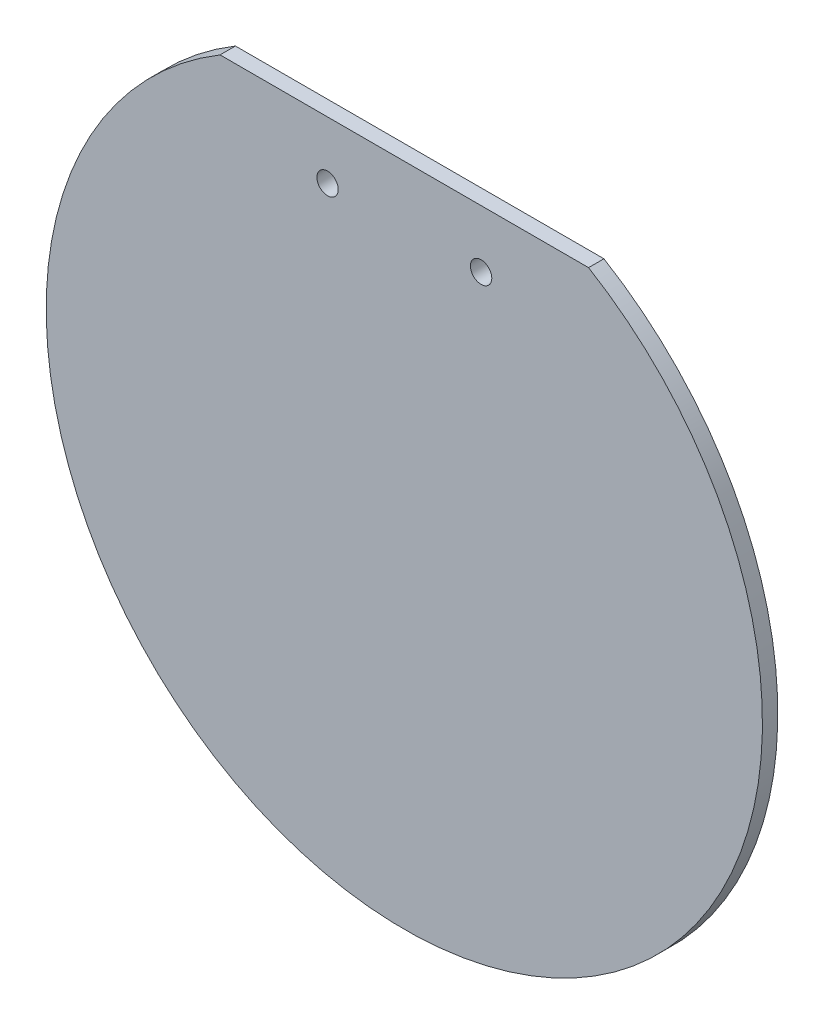
ISO-10303-21;
HEADER;
FILE_DESCRIPTION(('STEP AP214'),'2;1');
FILE_NAME('part.step','',(''),(''),'','','');
FILE_SCHEMA(('AUTOMOTIVE_DESIGN { 1 0 10303 214 1 1 1 1 }'));
ENDSEC;
DATA;
#1=APPLICATION_CONTEXT('core data for automotive mechanical design processes');
#2=APPLICATION_PROTOCOL_DEFINITION('international standard','automotive_design',2000,#1);
#3=PRODUCT_CONTEXT('',#1,'mechanical');
#4=PRODUCT('Part','Part','',(#3));
#5=PRODUCT_RELATED_PRODUCT_CATEGORY('part','',(#4));
#6=PRODUCT_DEFINITION_FORMATION('','',#4);
#7=PRODUCT_DEFINITION_CONTEXT('part definition',#1,'design');
#8=PRODUCT_DEFINITION('design','',#6,#7);
#9=PRODUCT_DEFINITION_SHAPE('','',#8);
#10=(LENGTH_UNIT() NAMED_UNIT(*) SI_UNIT(.MILLI.,.METRE.));
#11=(NAMED_UNIT(*) PLANE_ANGLE_UNIT() SI_UNIT($,.RADIAN.));
#12=(NAMED_UNIT(*) SI_UNIT($,.STERADIAN.) SOLID_ANGLE_UNIT());
#13=UNCERTAINTY_MEASURE_WITH_UNIT(LENGTH_MEASURE(1.E-05),#10,'distance_accuracy_value','');
#14=(GEOMETRIC_REPRESENTATION_CONTEXT(3) GLOBAL_UNCERTAINTY_ASSIGNED_CONTEXT((#13)) GLOBAL_UNIT_ASSIGNED_CONTEXT((#10,
#11,#12)) REPRESENTATION_CONTEXT('',''));
#15=CARTESIAN_POINT('',(0.,0.,0.));
#16=DIRECTION('',(0.,0.,1.));
#17=DIRECTION('',(1.,0.,0.));
#18=AXIS2_PLACEMENT_3D('',#15,#16,#17);
#19=CARTESIAN_POINT('',(0.,0.,1.5875));
#20=DIRECTION('',(0.,0.,-1.));
#21=DIRECTION('',(-1.,0.,0.));
#22=AXIS2_PLACEMENT_3D('',#19,#20,#21);
#23=CYLINDRICAL_SURFACE('',#22,37.0265445322677);
#24=CARTESIAN_POINT('',(0.,0.,0.));
#25=DIRECTION('',(0.,0.,1.));
#26=DIRECTION('',(1.,0.,0.));
#27=AXIS2_PLACEMENT_3D('',#24,#25,#26);
#28=CIRCLE('',#27,37.0265445322677);
#29=CARTESIAN_POINT('',(-19.05,31.75,0.));
#30=VERTEX_POINT('',#29);
#31=CARTESIAN_POINT('',(19.05,31.75,0.));
#32=VERTEX_POINT('',#31);
#33=EDGE_CURVE('E64',#30,#32,#28,.T.);
#34=ORIENTED_EDGE('',*,*,#33,.T.);
#35=DIRECTION('',(0.,0.,-1.));
#36=VECTOR('',#35,1.);
#37=CARTESIAN_POINT('',(19.05,31.75,1.5875));
#38=LINE('',#37,#36);
#39=CARTESIAN_POINT('',(19.05,31.75,1.5875));
#40=VERTEX_POINT('',#39);
#41=EDGE_CURVE('E11',#40,#32,#38,.T.);
#42=ORIENTED_EDGE('',*,*,#41,.F.);
#43=CARTESIAN_POINT('',(0.,0.,1.5875));
#44=DIRECTION('',(0.,0.,1.));
#45=DIRECTION('',(1.,0.,0.));
#46=AXIS2_PLACEMENT_3D('',#43,#44,#45);
#47=CIRCLE('',#46,37.0265445322677);
#48=CARTESIAN_POINT('',(-19.05,31.75,1.5875));
#49=VERTEX_POINT('',#48);
#50=EDGE_CURVE('E63',#49,#40,#47,.T.);
#51=ORIENTED_EDGE('',*,*,#50,.F.);
#52=DIRECTION('',(0.,0.,-1.));
#53=VECTOR('',#52,1.);
#54=CARTESIAN_POINT('',(-19.05,31.75,1.5875));
#55=LINE('',#54,#53);
#56=EDGE_CURVE('E41',#49,#30,#55,.T.);
#57=ORIENTED_EDGE('',*,*,#56,.T.);
#58=EDGE_LOOP('',(#34,#42,#51,#57));
#59=FACE_BOUND('',#58,.T.);
#60=ADVANCED_FACE('F33',(#59),#23,.T.);
#61=CARTESIAN_POINT('',(-19.05,31.75,1.5875));
#62=DIRECTION('',(0.,-1.,0.));
#63=DIRECTION('',(0.,0.,-1.));
#64=AXIS2_PLACEMENT_3D('',#61,#62,#63);
#65=PLANE('',#64);
#66=DIRECTION('',(-1.,0.,0.));
#67=VECTOR('',#66,1.);
#68=CARTESIAN_POINT('',(-19.05,31.75,0.));
#69=LINE('',#68,#67);
#70=EDGE_CURVE('E56',#32,#30,#69,.T.);
#71=ORIENTED_EDGE('',*,*,#70,.T.);
#72=ORIENTED_EDGE('',*,*,#56,.F.);
#73=DIRECTION('',(-1.,0.,0.));
#74=VECTOR('',#73,1.);
#75=CARTESIAN_POINT('',(-19.05,31.75,1.5875));
#76=LINE('',#75,#74);
#77=EDGE_CURVE('E48',#40,#49,#76,.T.);
#78=ORIENTED_EDGE('',*,*,#77,.F.);
#79=ORIENTED_EDGE('',*,*,#41,.T.);
#80=EDGE_LOOP('',(#71,#72,#78,#79));
#81=FACE_BOUND('',#80,.T.);
#82=ADVANCED_FACE('F59',(#81),#65,.F.);
#83=CARTESIAN_POINT('',(0.,0.,1.5875));
#84=DIRECTION('',(0.,0.,1.));
#85=DIRECTION('',(1.,0.,0.));
#86=AXIS2_PLACEMENT_3D('',#83,#84,#85);
#87=PLANE('',#86);
#88=CARTESIAN_POINT('',(7.93749999999999,25.79624,1.5875));
#89=DIRECTION('',(0.,0.,1.));
#90=DIRECTION('',(1.,0.,0.));
#91=AXIS2_PLACEMENT_3D('',#88,#89,#90);
#92=CIRCLE('',#91,1.1049);
#93=CARTESIAN_POINT('',(9.04239999999999,25.79624,1.5875));
#94=VERTEX_POINT('',#93);
#95=EDGE_CURVE('E71',#94,#94,#92,.T.);
#96=ORIENTED_EDGE('',*,*,#95,.F.);
#97=EDGE_LOOP('',(#96));
#98=FACE_BOUND('',#97,.T.);
#99=CARTESIAN_POINT('',(-7.93750000000002,25.79624,1.5875));
#100=DIRECTION('',(0.,0.,1.));
#101=DIRECTION('',(1.,0.,0.));
#102=AXIS2_PLACEMENT_3D('',#99,#100,#101);
#103=CIRCLE('',#102,1.1049);
#104=CARTESIAN_POINT('',(-6.83260000000002,25.79624,1.5875));
#105=VERTEX_POINT('',#104);
#106=EDGE_CURVE('E76',#105,#105,#103,.T.);
#107=ORIENTED_EDGE('',*,*,#106,.F.);
#108=EDGE_LOOP('',(#107));
#109=FACE_BOUND('',#108,.T.);
#110=ORIENTED_EDGE('',*,*,#50,.T.);
#111=ORIENTED_EDGE('',*,*,#77,.T.);
#112=EDGE_LOOP('',(#110,#111));
#113=FACE_BOUND('',#112,.T.);
#114=ADVANCED_FACE('F87',(#98,#109,#113),#87,.T.);
#115=CARTESIAN_POINT('',(0.,0.,0.));
#116=DIRECTION('',(0.,0.,1.));
#117=DIRECTION('',(1.,0.,0.));
#118=AXIS2_PLACEMENT_3D('',#115,#116,#117);
#119=PLANE('',#118);
#120=CARTESIAN_POINT('',(7.93749999999999,25.79624,0.));
#121=DIRECTION('',(0.,0.,1.));
#122=DIRECTION('',(1.,0.,0.));
#123=AXIS2_PLACEMENT_3D('',#120,#121,#122);
#124=CIRCLE('',#123,1.1049);
#125=CARTESIAN_POINT('',(9.04239999999999,25.79624,0.));
#126=VERTEX_POINT('',#125);
#127=EDGE_CURVE('E68',#126,#126,#124,.T.);
#128=ORIENTED_EDGE('',*,*,#127,.T.);
#129=EDGE_LOOP('',(#128));
#130=FACE_BOUND('',#129,.T.);
#131=CARTESIAN_POINT('',(-7.93750000000002,25.79624,0.));
#132=DIRECTION('',(0.,0.,1.));
#133=DIRECTION('',(1.,0.,0.));
#134=AXIS2_PLACEMENT_3D('',#131,#132,#133);
#135=CIRCLE('',#134,1.1049);
#136=CARTESIAN_POINT('',(-6.83260000000002,25.79624,0.));
#137=VERTEX_POINT('',#136);
#138=EDGE_CURVE('E79',#137,#137,#135,.T.);
#139=ORIENTED_EDGE('',*,*,#138,.T.);
#140=EDGE_LOOP('',(#139));
#141=FACE_BOUND('',#140,.T.);
#142=ORIENTED_EDGE('',*,*,#33,.F.);
#143=ORIENTED_EDGE('',*,*,#70,.F.);
#144=EDGE_LOOP('',(#142,#143));
#145=FACE_BOUND('',#144,.T.);
#146=ADVANCED_FACE('F67',(#130,#141,#145),#119,.F.);
#147=CARTESIAN_POINT('',(-7.93750000000002,25.79624,0.));
#148=DIRECTION('',(0.,0.,1.));
#149=DIRECTION('',(1.,0.,0.));
#150=AXIS2_PLACEMENT_3D('',#147,#148,#149);
#151=CYLINDRICAL_SURFACE('',#150,1.1049);
#152=ORIENTED_EDGE('',*,*,#138,.F.);
#153=EDGE_LOOP('',(#152));
#154=FACE_BOUND('',#153,.T.);
#155=ORIENTED_EDGE('',*,*,#106,.T.);
#156=EDGE_LOOP('',(#155));
#157=FACE_BOUND('',#156,.T.);
#158=ADVANCED_FACE('F93',(#154,#157),#151,.F.);
#159=CARTESIAN_POINT('',(7.93749999999999,25.79624,0.));
#160=DIRECTION('',(0.,0.,1.));
#161=DIRECTION('',(1.,0.,0.));
#162=AXIS2_PLACEMENT_3D('',#159,#160,#161);
#163=CYLINDRICAL_SURFACE('',#162,1.1049);
#164=ORIENTED_EDGE('',*,*,#127,.F.);
#165=EDGE_LOOP('',(#164));
#166=FACE_BOUND('',#165,.T.);
#167=ORIENTED_EDGE('',*,*,#95,.T.);
#168=EDGE_LOOP('',(#167));
#169=FACE_BOUND('',#168,.T.);
#170=ADVANCED_FACE('F85',(#166,#169),#163,.F.);
#171=CLOSED_SHELL('',(#60,#82,#114,#146,#158,#170));
#172=MANIFOLD_SOLID_BREP('B2',#171);
#173=ADVANCED_BREP_SHAPE_REPRESENTATION('',(#18,#172),#14);
#174=SHAPE_DEFINITION_REPRESENTATION(#9,#173);
ENDSEC;
END-ISO-10303-21;
